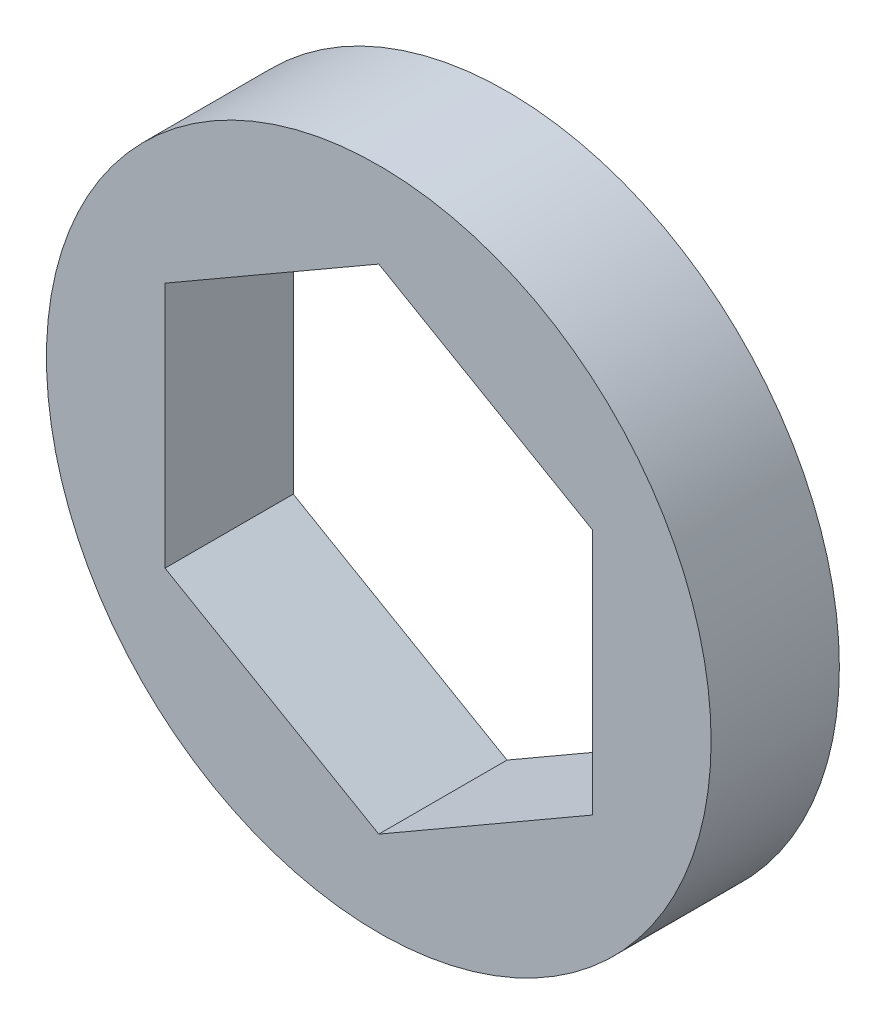
ISO-10303-21;
HEADER;
FILE_DESCRIPTION(('STEP AP214'),'2;1');
FILE_NAME('part.step','',(''),(''),'','','');
FILE_SCHEMA(('AUTOMOTIVE_DESIGN { 1 0 10303 214 1 1 1 1 }'));
ENDSEC;
DATA;
#1=APPLICATION_CONTEXT('core data for automotive mechanical design processes');
#2=APPLICATION_PROTOCOL_DEFINITION('international standard','automotive_design',2000,#1);
#3=PRODUCT_CONTEXT('',#1,'mechanical');
#4=PRODUCT('Part','Part','',(#3));
#5=PRODUCT_RELATED_PRODUCT_CATEGORY('part','',(#4));
#6=PRODUCT_DEFINITION_FORMATION('','',#4);
#7=PRODUCT_DEFINITION_CONTEXT('part definition',#1,'design');
#8=PRODUCT_DEFINITION('design','',#6,#7);
#9=PRODUCT_DEFINITION_SHAPE('','',#8);
#10=(LENGTH_UNIT() NAMED_UNIT(*) SI_UNIT(.MILLI.,.METRE.));
#11=(NAMED_UNIT(*) PLANE_ANGLE_UNIT() SI_UNIT($,.RADIAN.));
#12=(NAMED_UNIT(*) SI_UNIT($,.STERADIAN.) SOLID_ANGLE_UNIT());
#13=UNCERTAINTY_MEASURE_WITH_UNIT(LENGTH_MEASURE(1.E-05),#10,'distance_accuracy_value','');
#14=(GEOMETRIC_REPRESENTATION_CONTEXT(3) GLOBAL_UNCERTAINTY_ASSIGNED_CONTEXT((#13)) GLOBAL_UNIT_ASSIGNED_CONTEXT((#10,
#11,#12)) REPRESENTATION_CONTEXT('',''));
#15=CARTESIAN_POINT('',(0.,0.,0.));
#16=DIRECTION('',(0.,0.,1.));
#17=DIRECTION('',(1.,0.,0.));
#18=AXIS2_PLACEMENT_3D('',#15,#16,#17);
#19=CARTESIAN_POINT('',(-128.75212267549,2.16506350946108,1.5));
#20=DIRECTION('',(-0.5,-0.866025403784438,0.));
#21=DIRECTION('',(0.866025403784438,-0.5,0.));
#22=AXIS2_PLACEMENT_3D('',#19,#20,#21);
#23=PLANE('',#22);
#24=DIRECTION('',(-0.866025403784438,0.5,0.));
#25=VECTOR('',#24,1.);
#26=CARTESIAN_POINT('',(-128.75212267549,2.16506350946108,0.));
#27=LINE('',#26,#25);
#28=CARTESIAN_POINT('',(-127.50212267549,1.44337567297406,0.));
#29=VERTEX_POINT('',#28);
#30=CARTESIAN_POINT('',(-130.00212267549,2.88675134594815,0.));
#31=VERTEX_POINT('',#30);
#32=EDGE_CURVE('E11',#29,#31,#27,.T.);
#33=ORIENTED_EDGE('',*,*,#32,.F.);
#34=DIRECTION('',(0.,0.,-1.));
#35=VECTOR('',#34,1.);
#36=CARTESIAN_POINT('',(-127.50212267549,1.44337567297406,1.5));
#37=LINE('',#36,#35);
#38=CARTESIAN_POINT('',(-127.50212267549,1.44337567297406,1.5));
#39=VERTEX_POINT('',#38);
#40=EDGE_CURVE('E23',#39,#29,#37,.T.);
#41=ORIENTED_EDGE('',*,*,#40,.F.);
#42=DIRECTION('',(-0.866025403784438,0.5,0.));
#43=VECTOR('',#42,1.);
#44=CARTESIAN_POINT('',(-128.75212267549,2.16506350946108,1.5));
#45=LINE('',#44,#43);
#46=CARTESIAN_POINT('',(-130.00212267549,2.88675134594815,1.5));
#47=VERTEX_POINT('',#46);
#48=EDGE_CURVE('E119',#39,#47,#45,.T.);
#49=ORIENTED_EDGE('',*,*,#48,.T.);
#50=DIRECTION('',(0.,0.,-1.));
#51=VECTOR('',#50,1.);
#52=CARTESIAN_POINT('',(-130.00212267549,2.88675134594815,1.5));
#53=LINE('',#52,#51);
#54=EDGE_CURVE('E80',#47,#31,#53,.T.);
#55=ORIENTED_EDGE('',*,*,#54,.T.);
#56=EDGE_LOOP('',(#33,#41,#49,#55));
#57=FACE_BOUND('',#56,.T.);
#58=ADVANCED_FACE('F16',(#57),#23,.T.);
#59=CARTESIAN_POINT('',(-127.50212267549,0.,1.5));
#60=DIRECTION('',(-1.,0.,0.));
#61=DIRECTION('',(0.,0.,1.));
#62=AXIS2_PLACEMENT_3D('',#59,#60,#61);
#63=PLANE('',#62);
#64=DIRECTION('',(0.,1.,0.));
#65=VECTOR('',#64,1.);
#66=CARTESIAN_POINT('',(-127.50212267549,0.,0.));
#67=LINE('',#66,#65);
#68=CARTESIAN_POINT('',(-127.50212267549,-1.44337567297406,0.));
#69=VERTEX_POINT('',#68);
#70=EDGE_CURVE('E115',#69,#29,#67,.T.);
#71=ORIENTED_EDGE('',*,*,#70,.F.);
#72=DIRECTION('',(0.,0.,-1.));
#73=VECTOR('',#72,1.);
#74=CARTESIAN_POINT('',(-127.50212267549,-1.44337567297406,1.5));
#75=LINE('',#74,#73);
#76=CARTESIAN_POINT('',(-127.50212267549,-1.44337567297406,1.5));
#77=VERTEX_POINT('',#76);
#78=EDGE_CURVE('E112',#77,#69,#75,.T.);
#79=ORIENTED_EDGE('',*,*,#78,.F.);
#80=DIRECTION('',(0.,1.,0.));
#81=VECTOR('',#80,1.);
#82=CARTESIAN_POINT('',(-127.50212267549,0.,1.5));
#83=LINE('',#82,#81);
#84=EDGE_CURVE('E110',#77,#39,#83,.T.);
#85=ORIENTED_EDGE('',*,*,#84,.T.);
#86=ORIENTED_EDGE('',*,*,#40,.T.);
#87=EDGE_LOOP('',(#71,#79,#85,#86));
#88=FACE_BOUND('',#87,.T.);
#89=ADVANCED_FACE('F121',(#88),#63,.T.);
#90=CARTESIAN_POINT('',(-128.75212267549,-2.1650635094611,1.5));
#91=DIRECTION('',(-0.5,0.866025403784439,0.));
#92=DIRECTION('',(-0.866025403784439,-0.5,0.));
#93=AXIS2_PLACEMENT_3D('',#90,#91,#92);
#94=PLANE('',#93);
#95=DIRECTION('',(0.866025403784439,0.5,0.));
#96=VECTOR('',#95,1.);
#97=CARTESIAN_POINT('',(-128.75212267549,-2.1650635094611,0.));
#98=LINE('',#97,#96);
#99=CARTESIAN_POINT('',(-130.00212267549,-2.88675134594816,0.));
#100=VERTEX_POINT('',#99);
#101=EDGE_CURVE('E107',#100,#69,#98,.T.);
#102=ORIENTED_EDGE('',*,*,#101,.F.);
#103=DIRECTION('',(0.,0.,-1.));
#104=VECTOR('',#103,1.);
#105=CARTESIAN_POINT('',(-130.00212267549,-2.88675134594816,1.5));
#106=LINE('',#105,#104);
#107=CARTESIAN_POINT('',(-130.00212267549,-2.88675134594816,1.5));
#108=VERTEX_POINT('',#107);
#109=EDGE_CURVE('E104',#108,#100,#106,.T.);
#110=ORIENTED_EDGE('',*,*,#109,.F.);
#111=DIRECTION('',(0.866025403784439,0.5,0.));
#112=VECTOR('',#111,1.);
#113=CARTESIAN_POINT('',(-128.75212267549,-2.1650635094611,1.5));
#114=LINE('',#113,#112);
#115=EDGE_CURVE('E101',#108,#77,#114,.T.);
#116=ORIENTED_EDGE('',*,*,#115,.T.);
#117=ORIENTED_EDGE('',*,*,#78,.T.);
#118=EDGE_LOOP('',(#102,#110,#116,#117));
#119=FACE_BOUND('',#118,.T.);
#120=ADVANCED_FACE('F127',(#119),#94,.T.);
#121=CARTESIAN_POINT('',(-131.25212267549,-2.16506350946113,1.5));
#122=DIRECTION('',(0.5,0.866025403784438,0.));
#123=DIRECTION('',(-0.866025403784438,0.5,0.));
#124=AXIS2_PLACEMENT_3D('',#121,#122,#123);
#125=PLANE('',#124);
#126=DIRECTION('',(0.866025403784438,-0.5,0.));
#127=VECTOR('',#126,1.);
#128=CARTESIAN_POINT('',(-131.25212267549,-2.16506350946113,0.));
#129=LINE('',#128,#127);
#130=CARTESIAN_POINT('',(-132.50212267549,-1.44337567297411,0.));
#131=VERTEX_POINT('',#130);
#132=EDGE_CURVE('E98',#131,#100,#129,.T.);
#133=ORIENTED_EDGE('',*,*,#132,.F.);
#134=DIRECTION('',(0.,0.,-1.));
#135=VECTOR('',#134,1.);
#136=CARTESIAN_POINT('',(-132.50212267549,-1.44337567297411,1.5));
#137=LINE('',#136,#135);
#138=CARTESIAN_POINT('',(-132.50212267549,-1.44337567297411,1.5));
#139=VERTEX_POINT('',#138);
#140=EDGE_CURVE('E96',#139,#131,#137,.T.);
#141=ORIENTED_EDGE('',*,*,#140,.F.);
#142=DIRECTION('',(0.866025403784438,-0.5,0.));
#143=VECTOR('',#142,1.);
#144=CARTESIAN_POINT('',(-131.25212267549,-2.16506350946113,1.5));
#145=LINE('',#144,#143);
#146=EDGE_CURVE('E90',#139,#108,#145,.T.);
#147=ORIENTED_EDGE('',*,*,#146,.T.);
#148=ORIENTED_EDGE('',*,*,#109,.T.);
#149=EDGE_LOOP('',(#133,#141,#147,#148));
#150=FACE_BOUND('',#149,.T.);
#151=ADVANCED_FACE('F129',(#150),#125,.T.);
#152=CARTESIAN_POINT('',(-132.50212267549,0.,1.5));
#153=DIRECTION('',(1.,0.,0.));
#154=DIRECTION('',(0.,0.,-1.));
#155=AXIS2_PLACEMENT_3D('',#152,#153,#154);
#156=PLANE('',#155);
#157=DIRECTION('',(0.,-1.,0.));
#158=VECTOR('',#157,1.);
#159=CARTESIAN_POINT('',(-132.50212267549,0.,0.));
#160=LINE('',#159,#158);
#161=CARTESIAN_POINT('',(-132.50212267549,1.44337567297407,0.));
#162=VERTEX_POINT('',#161);
#163=EDGE_CURVE('E71',#162,#131,#160,.T.);
#164=ORIENTED_EDGE('',*,*,#163,.F.);
#165=DIRECTION('',(0.,0.,-1.));
#166=VECTOR('',#165,1.);
#167=CARTESIAN_POINT('',(-132.50212267549,1.44337567297407,1.5));
#168=LINE('',#167,#166);
#169=CARTESIAN_POINT('',(-132.50212267549,1.44337567297407,1.5));
#170=VERTEX_POINT('',#169);
#171=EDGE_CURVE('E63',#170,#162,#168,.T.);
#172=ORIENTED_EDGE('',*,*,#171,.F.);
#173=DIRECTION('',(0.,-1.,0.));
#174=VECTOR('',#173,1.);
#175=CARTESIAN_POINT('',(-132.50212267549,0.,1.5));
#176=LINE('',#175,#174);
#177=EDGE_CURVE('E68',#170,#139,#176,.T.);
#178=ORIENTED_EDGE('',*,*,#177,.T.);
#179=ORIENTED_EDGE('',*,*,#140,.T.);
#180=EDGE_LOOP('',(#164,#172,#178,#179));
#181=FACE_BOUND('',#180,.T.);
#182=ADVANCED_FACE('F65',(#181),#156,.T.);
#183=CARTESIAN_POINT('',(-131.25212267549,2.16506350946112,1.5));
#184=DIRECTION('',(0.5,-0.866025403784439,0.));
#185=DIRECTION('',(0.86602540378444,0.5,0.));
#186=AXIS2_PLACEMENT_3D('',#183,#184,#185);
#187=PLANE('',#186);
#188=DIRECTION('',(-0.866025403784439,-0.499999999999999,0.));
#189=VECTOR('',#188,1.);
#190=CARTESIAN_POINT('',(-131.25212267549,2.16506350946112,0.));
#191=LINE('',#190,#189);
#192=EDGE_CURVE('E83',#31,#162,#191,.T.);
#193=ORIENTED_EDGE('',*,*,#192,.F.);
#194=ORIENTED_EDGE('',*,*,#54,.F.);
#195=DIRECTION('',(-0.866025403784439,-0.499999999999999,0.));
#196=VECTOR('',#195,1.);
#197=CARTESIAN_POINT('',(-131.25212267549,2.16506350946112,1.5));
#198=LINE('',#197,#196);
#199=EDGE_CURVE('E78',#47,#170,#198,.T.);
#200=ORIENTED_EDGE('',*,*,#199,.T.);
#201=ORIENTED_EDGE('',*,*,#171,.T.);
#202=EDGE_LOOP('',(#193,#194,#200,#201));
#203=FACE_BOUND('',#202,.T.);
#204=ADVANCED_FACE('F79',(#203),#187,.T.);
#205=CARTESIAN_POINT('',(-130.00212267549,0.,1.5));
#206=DIRECTION('',(0.,0.,-1.));
#207=DIRECTION('',(-1.,0.,0.));
#208=AXIS2_PLACEMENT_3D('',#205,#206,#207);
#209=CYLINDRICAL_SURFACE('',#208,3.88675134594813);
#210=CARTESIAN_POINT('',(-130.00212267549,0.,1.5));
#211=DIRECTION('',(0.,0.,1.));
#212=DIRECTION('',(1.,0.,0.));
#213=AXIS2_PLACEMENT_3D('',#210,#211,#212);
#214=CIRCLE('',#213,3.88675134594813);
#215=CARTESIAN_POINT('',(-126.115371329542,0.,1.5));
#216=VERTEX_POINT('',#215);
#217=EDGE_CURVE('E84',#216,#216,#214,.T.);
#218=ORIENTED_EDGE('',*,*,#217,.F.);
#219=EDGE_LOOP('',(#218));
#220=FACE_BOUND('',#219,.T.);
#221=CARTESIAN_POINT('',(-130.00212267549,0.,0.));
#222=DIRECTION('',(0.,0.,1.));
#223=DIRECTION('',(1.,0.,0.));
#224=AXIS2_PLACEMENT_3D('',#221,#222,#223);
#225=CIRCLE('',#224,3.88675134594813);
#226=CARTESIAN_POINT('',(-126.115371329542,0.,0.));
#227=VERTEX_POINT('',#226);
#228=EDGE_CURVE('E220',#227,#227,#225,.T.);
#229=ORIENTED_EDGE('',*,*,#228,.T.);
#230=EDGE_LOOP('',(#229));
#231=FACE_BOUND('',#230,.T.);
#232=ADVANCED_FACE('F146',(#220,#231),#209,.T.);
#233=CARTESIAN_POINT('',(-85.50212267549,0.,1.5));
#234=DIRECTION('',(0.,0.,1.));
#235=DIRECTION('',(1.,0.,0.));
#236=AXIS2_PLACEMENT_3D('',#233,#234,#235);
#237=PLANE('',#236);
#238=ORIENTED_EDGE('',*,*,#48,.F.);
#239=ORIENTED_EDGE('',*,*,#84,.F.);
#240=ORIENTED_EDGE('',*,*,#115,.F.);
#241=ORIENTED_EDGE('',*,*,#146,.F.);
#242=ORIENTED_EDGE('',*,*,#177,.F.);
#243=ORIENTED_EDGE('',*,*,#199,.F.);
#244=EDGE_LOOP('',(#238,#239,#240,#241,#242,#243));
#245=FACE_BOUND('',#244,.T.);
#246=ORIENTED_EDGE('',*,*,#217,.T.);
#247=EDGE_LOOP('',(#246));
#248=FACE_BOUND('',#247,.T.);
#249=ADVANCED_FACE('F86',(#245,#248),#237,.T.);
#250=CARTESIAN_POINT('',(-85.50212267549,0.,0.));
#251=DIRECTION('',(0.,0.,1.));
#252=DIRECTION('',(1.,0.,0.));
#253=AXIS2_PLACEMENT_3D('',#250,#251,#252);
#254=PLANE('',#253);
#255=ORIENTED_EDGE('',*,*,#32,.T.);
#256=ORIENTED_EDGE('',*,*,#192,.T.);
#257=ORIENTED_EDGE('',*,*,#163,.T.);
#258=ORIENTED_EDGE('',*,*,#132,.T.);
#259=ORIENTED_EDGE('',*,*,#101,.T.);
#260=ORIENTED_EDGE('',*,*,#70,.T.);
#261=EDGE_LOOP('',(#255,#256,#257,#258,#259,#260));
#262=FACE_BOUND('',#261,.T.);
#263=ORIENTED_EDGE('',*,*,#228,.F.);
#264=EDGE_LOOP('',(#263));
#265=FACE_BOUND('',#264,.T.);
#266=ADVANCED_FACE('F124',(#262,#265),#254,.F.);
#267=CLOSED_SHELL('',(#58,#89,#120,#151,#182,#204,#232,#249,#266));
#268=MANIFOLD_SOLID_BREP('B1',#267);
#269=ADVANCED_BREP_SHAPE_REPRESENTATION('',(#18,#268),#14);
#270=SHAPE_DEFINITION_REPRESENTATION(#9,#269);
ENDSEC;
END-ISO-10303-21;
